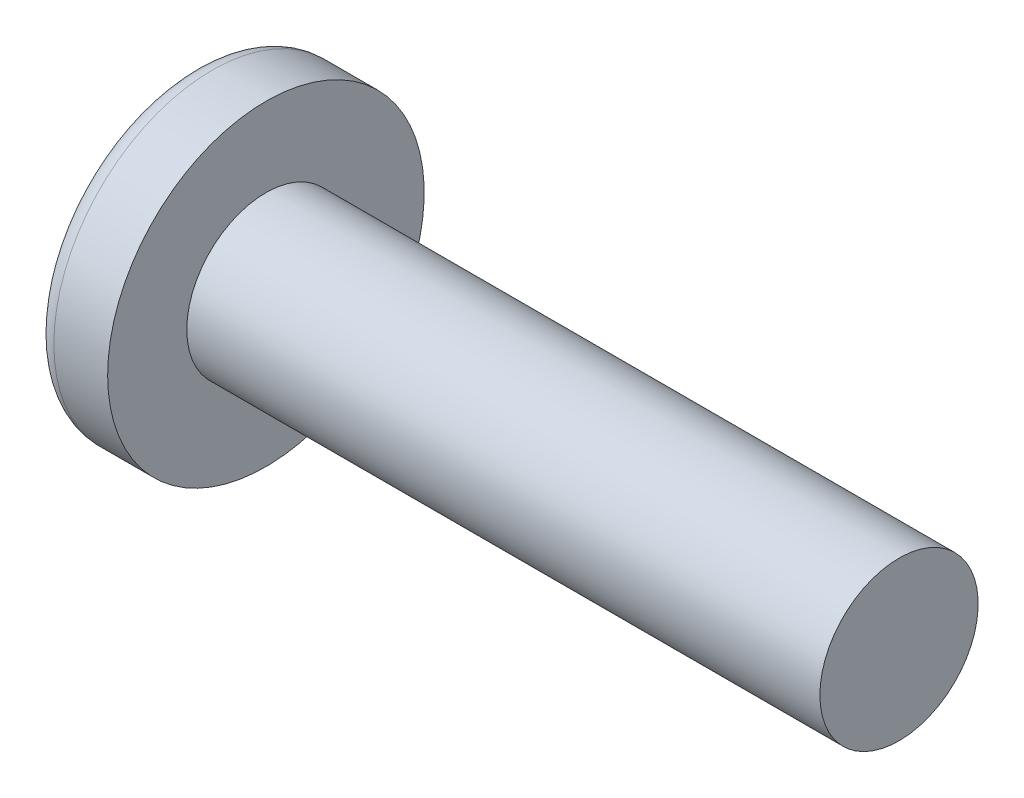
ISO-10303-21;
HEADER;
FILE_DESCRIPTION(('STEP AP214'),'2;1');
FILE_NAME('part.step','',(''),(''),'','','');
FILE_SCHEMA(('AUTOMOTIVE_DESIGN { 1 0 10303 214 1 1 1 1 }'));
ENDSEC;
DATA;
#1=APPLICATION_CONTEXT('core data for automotive mechanical design processes');
#2=APPLICATION_PROTOCOL_DEFINITION('international standard','automotive_design',2000,#1);
#3=PRODUCT_CONTEXT('',#1,'mechanical');
#4=PRODUCT('Part','Part','',(#3));
#5=PRODUCT_RELATED_PRODUCT_CATEGORY('part','',(#4));
#6=PRODUCT_DEFINITION_FORMATION('','',#4);
#7=PRODUCT_DEFINITION_CONTEXT('part definition',#1,'design');
#8=PRODUCT_DEFINITION('design','',#6,#7);
#9=PRODUCT_DEFINITION_SHAPE('','',#8);
#10=(LENGTH_UNIT() NAMED_UNIT(*) SI_UNIT(.MILLI.,.METRE.));
#11=(NAMED_UNIT(*) PLANE_ANGLE_UNIT() SI_UNIT($,.RADIAN.));
#12=(NAMED_UNIT(*) SI_UNIT($,.STERADIAN.) SOLID_ANGLE_UNIT());
#13=UNCERTAINTY_MEASURE_WITH_UNIT(LENGTH_MEASURE(1.E-05),#10,'distance_accuracy_value','');
#14=(GEOMETRIC_REPRESENTATION_CONTEXT(3) GLOBAL_UNCERTAINTY_ASSIGNED_CONTEXT((#13)) GLOBAL_UNIT_ASSIGNED_CONTEXT((#10,
#11,#12)) REPRESENTATION_CONTEXT('',''));
#15=CARTESIAN_POINT('',(0.,0.,0.));
#16=DIRECTION('',(0.,0.,1.));
#17=DIRECTION('',(1.,0.,0.));
#18=AXIS2_PLACEMENT_3D('',#15,#16,#17);
#19=CARTESIAN_POINT('',(16.,0.,0.));
#20=DIRECTION('',(-1.,0.,0.));
#21=DIRECTION('',(0.,1.,0.));
#22=AXIS2_PLACEMENT_3D('',#19,#20,#21);
#23=SPHERICAL_SURFACE('',#22,16.);
#24=CARTESIAN_POINT('',(3.13558937890291,0.,0.));
#25=DIRECTION('',(-1.,0.,0.));
#26=DIRECTION('',(0.,0.,1.));
#27=AXIS2_PLACEMENT_3D('',#24,#25,#26);
#28=CIRCLE('',#27,9.51351351351351);
#29=CARTESIAN_POINT('',(3.13558937890291,0.,9.51351351351351));
#30=VERTEX_POINT('',#29);
#31=EDGE_CURVE('E152',#30,#30,#28,.T.);
#32=ORIENTED_EDGE('',*,*,#31,.T.);
#33=EDGE_LOOP('',(#32));
#34=FACE_BOUND('',#33,.T.);
#35=CARTESIAN_POINT('',(15.9783292627018,-0.286901717708185,0.));
#36=DIRECTION('',(-0.0753191069988102,-0.997159481788596,0.));
#37=DIRECTION('',(0.997159481788596,-0.0753191069988102,0.));
#38=AXIS2_PLACEMENT_3D('',#35,#36,#37);
#39=CIRCLE('',#38,15.9974128465674);
#40=CARTESIAN_POINT('',(0.689797493113337,0.867897069485676,4.56557267764947));
#41=VERTEX_POINT('',#40);
#42=CARTESIAN_POINT('',(0.0525309152497253,0.916032147616602,0.916032147616605));
#43=VERTEX_POINT('',#42);
#44=EDGE_CURVE('E183',#41,#43,#39,.T.);
#45=ORIENTED_EDGE('',*,*,#44,.F.);
#46=CARTESIAN_POINT('',(12.5917266638189,0.,-4.48302043571123));
#47=DIRECTION('',(0.605215831317699,0.,0.796061428234295));
#48=DIRECTION('',(0.796061428234295,0.,-0.605215831317699));
#49=AXIS2_PLACEMENT_3D('',#46,#47,#48);
#50=CIRCLE('',#49,14.9761877872465);
#51=CARTESIAN_POINT('',(0.689797493113337,-0.867897069485708,4.56557267764947));
#52=VERTEX_POINT('',#51);
#53=EDGE_CURVE('E148',#41,#52,#50,.T.);
#54=ORIENTED_EDGE('',*,*,#53,.T.);
#55=CARTESIAN_POINT('',(15.9783292627018,0.286901717708185,0.));
#56=DIRECTION('',(-0.0753191069988101,0.997159481788596,0.));
#57=DIRECTION('',(-0.997159481788596,-0.0753191069988101,0.));
#58=AXIS2_PLACEMENT_3D('',#55,#56,#57);
#59=CIRCLE('',#58,15.9974128465674);
#60=CARTESIAN_POINT('',(0.0525309152497253,-0.916032147616608,0.916032147616604));
#61=VERTEX_POINT('',#60);
#62=EDGE_CURVE('E104',#61,#52,#59,.T.);
#63=ORIENTED_EDGE('',*,*,#62,.F.);
#64=CARTESIAN_POINT('',(15.9783292627018,0.,-0.286901717708185));
#65=DIRECTION('',(-0.0753191069988101,0.,-0.997159481788596));
#66=DIRECTION('',(-0.997159481788596,0.,0.0753191069988101));
#67=AXIS2_PLACEMENT_3D('',#64,#65,#66);
#68=CIRCLE('',#67,15.9974128465674);
#69=CARTESIAN_POINT('',(0.689797493113332,-4.56557267764947,0.867897069485691));
#70=VERTEX_POINT('',#69);
#71=EDGE_CURVE('E129',#70,#61,#68,.T.);
#72=ORIENTED_EDGE('',*,*,#71,.F.);
#73=CARTESIAN_POINT('',(12.5917266638189,4.48302043571123,0.));
#74=DIRECTION('',(0.605215831317699,-0.796061428234295,0.));
#75=DIRECTION('',(0.796061428234295,0.605215831317699,0.));
#76=AXIS2_PLACEMENT_3D('',#73,#74,#75);
#77=CIRCLE('',#76,14.9761877872465);
#78=CARTESIAN_POINT('',(0.689797493113332,-4.56557267764947,-0.867897069485692));
#79=VERTEX_POINT('',#78);
#80=EDGE_CURVE('E137',#70,#79,#77,.T.);
#81=ORIENTED_EDGE('',*,*,#80,.T.);
#82=CARTESIAN_POINT('',(15.9783292627018,0.,0.286901717708185));
#83=DIRECTION('',(-0.0753191069988102,0.,0.997159481788596));
#84=DIRECTION('',(0.997159481788596,0.,0.0753191069988102));
#85=AXIS2_PLACEMENT_3D('',#82,#83,#84);
#86=CIRCLE('',#85,15.9974128465674);
#87=CARTESIAN_POINT('',(0.0525309152497253,-0.916032147616601,-0.916032147616605));
#88=VERTEX_POINT('',#87);
#89=EDGE_CURVE('E47',#88,#79,#86,.T.);
#90=ORIENTED_EDGE('',*,*,#89,.F.);
#91=CARTESIAN_POINT('',(0.689797493113332,-0.867897069485675,-4.56557267764947));
#92=VERTEX_POINT('',#91);
#93=EDGE_CURVE('E190',#92,#88,#59,.T.);
#94=ORIENTED_EDGE('',*,*,#93,.F.);
#95=CARTESIAN_POINT('',(12.5917266638189,0.,4.48302043571123));
#96=DIRECTION('',(0.605215831317699,0.,-0.796061428234295));
#97=DIRECTION('',(-0.796061428234295,0.,-0.605215831317699));
#98=AXIS2_PLACEMENT_3D('',#95,#96,#97);
#99=CIRCLE('',#98,14.9761877872465);
#100=CARTESIAN_POINT('',(0.689797493113334,0.867897069485708,-4.56557267764947));
#101=VERTEX_POINT('',#100);
#102=EDGE_CURVE('E130',#92,#101,#99,.T.);
#103=ORIENTED_EDGE('',*,*,#102,.T.);
#104=CARTESIAN_POINT('',(0.0525309152497253,0.916032147616608,-0.916032147616605));
#105=VERTEX_POINT('',#104);
#106=EDGE_CURVE('E178',#105,#101,#39,.T.);
#107=ORIENTED_EDGE('',*,*,#106,.F.);
#108=CARTESIAN_POINT('',(0.689797493113339,4.56557267764947,-0.867897069485692));
#109=VERTEX_POINT('',#108);
#110=EDGE_CURVE('E40',#109,#105,#86,.T.);
#111=ORIENTED_EDGE('',*,*,#110,.F.);
#112=CARTESIAN_POINT('',(12.5917266638189,-4.48302043571123,0.));
#113=DIRECTION('',(0.605215831317699,0.796061428234295,0.));
#114=DIRECTION('',(-0.796061428234295,0.605215831317699,0.));
#115=AXIS2_PLACEMENT_3D('',#112,#113,#114);
#116=CIRCLE('',#115,14.9761877872465);
#117=CARTESIAN_POINT('',(0.689797493113339,4.56557267764947,0.867897069485692));
#118=VERTEX_POINT('',#117);
#119=EDGE_CURVE('E11',#109,#118,#116,.T.);
#120=ORIENTED_EDGE('',*,*,#119,.T.);
#121=EDGE_CURVE('E166',#43,#118,#68,.T.);
#122=ORIENTED_EDGE('',*,*,#121,.F.);
#123=EDGE_LOOP('',(#45,#54,#63,#72,#81,#90,#94,#103,#107,#111,#120,#122));
#124=FACE_BOUND('',#123,.T.);
#125=ADVANCED_FACE('F32',(#34,#124),#23,.T.);
#126=CARTESIAN_POINT('',(6.69505399568035,0.,-0.414298056155508));
#127=DIRECTION('',(-0.0753191069988102,0.,0.997159481788596));
#128=DIRECTION('',(0.997159481788596,0.,0.0753191069988102));
#129=AXIS2_PLACEMENT_3D('',#126,#127,#128);
#130=PLANE('',#129);
#131=ORIENTED_EDGE('',*,*,#110,.T.);
#132=DIRECTION('',(0.994343032504054,-0.0751063702712424,0.0751063702712422));
#133=VECTOR('',#132,1.);
#134=CARTESIAN_POINT('',(6.72599439429394,0.411961014552512,-0.41196101455251));
#135=LINE('',#134,#133);
#136=CARTESIAN_POINT('',(6.09,0.460000000000002,-0.459999999999998));
#137=VERTEX_POINT('',#136);
#138=EDGE_CURVE('E172',#105,#137,#135,.T.);
#139=ORIENTED_EDGE('',*,*,#138,.T.);
#140=DIRECTION('',(0.794626219349906,-0.60412469549919,0.0600210280625545));
#141=VECTOR('',#140,1.);
#142=CARTESIAN_POINT('',(0.,5.09,-0.92));
#143=LINE('',#142,#141);
#144=EDGE_CURVE('E153',#109,#137,#143,.T.);
#145=ORIENTED_EDGE('',*,*,#144,.F.);
#146=EDGE_LOOP('',(#131,#139,#145));
#147=FACE_BOUND('',#146,.T.);
#148=ADVANCED_FACE('F171',(#147),#130,.T.);
#149=DIRECTION('',(0.794626219349906,0.60412469549919,0.0600210280625545));
#150=VECTOR('',#149,1.);
#151=CARTESIAN_POINT('',(0.,-5.09,-0.92));
#152=LINE('',#151,#150);
#153=CARTESIAN_POINT('',(6.09,-0.46,-0.46));
#154=VERTEX_POINT('',#153);
#155=EDGE_CURVE('E138',#79,#154,#152,.T.);
#156=ORIENTED_EDGE('',*,*,#155,.T.);
#157=DIRECTION('',(-0.994343032504054,-0.0751063702712418,-0.0751063702712422));
#158=VECTOR('',#157,1.);
#159=CARTESIAN_POINT('',(6.72599439429394,-0.411961014552509,-0.41196101455251));
#160=LINE('',#159,#158);
#161=EDGE_CURVE('E193',#154,#88,#160,.T.);
#162=ORIENTED_EDGE('',*,*,#161,.T.);
#163=ORIENTED_EDGE('',*,*,#89,.T.);
#164=EDGE_LOOP('',(#156,#162,#163));
#165=FACE_BOUND('',#164,.T.);
#166=ADVANCED_FACE('F208',(#165),#130,.T.);
#167=CARTESIAN_POINT('',(6.69505399568034,0.,0.414298056155508));
#168=DIRECTION('',(-0.0753191069988101,0.,-0.997159481788596));
#169=DIRECTION('',(-0.997159481788596,0.,0.0753191069988101));
#170=AXIS2_PLACEMENT_3D('',#167,#168,#169);
#171=PLANE('',#170);
#172=DIRECTION('',(0.794626219349906,-0.60412469549919,-0.0600210280625545));
#173=VECTOR('',#172,1.);
#174=CARTESIAN_POINT('',(0.,5.09,0.92));
#175=LINE('',#174,#173);
#176=CARTESIAN_POINT('',(6.09,0.460000000000001,0.46));
#177=VERTEX_POINT('',#176);
#178=EDGE_CURVE('E209',#118,#177,#175,.T.);
#179=ORIENTED_EDGE('',*,*,#178,.T.);
#180=DIRECTION('',(-0.994343032504054,0.0751063702712419,0.0751063702712421));
#181=VECTOR('',#180,1.);
#182=CARTESIAN_POINT('',(6.72599439429394,0.411961014552509,0.411961014552511));
#183=LINE('',#182,#181);
#184=EDGE_CURVE('E187',#177,#43,#183,.T.);
#185=ORIENTED_EDGE('',*,*,#184,.T.);
#186=ORIENTED_EDGE('',*,*,#121,.T.);
#187=EDGE_LOOP('',(#179,#185,#186));
#188=FACE_BOUND('',#187,.T.);
#189=ADVANCED_FACE('F213',(#188),#171,.T.);
#190=ORIENTED_EDGE('',*,*,#71,.T.);
#191=DIRECTION('',(0.994343032504054,0.0751063702712424,-0.0751063702712421));
#192=VECTOR('',#191,1.);
#193=CARTESIAN_POINT('',(6.72599439429394,-0.411961014552512,0.41196101455251));
#194=LINE('',#193,#192);
#195=CARTESIAN_POINT('',(6.09,-0.460000000000002,0.459999999999999));
#196=VERTEX_POINT('',#195);
#197=EDGE_CURVE('E102',#61,#196,#194,.T.);
#198=ORIENTED_EDGE('',*,*,#197,.T.);
#199=DIRECTION('',(0.794626219349906,0.60412469549919,-0.0600210280625543));
#200=VECTOR('',#199,1.);
#201=CARTESIAN_POINT('',(0.,-5.09,0.919999999999999));
#202=LINE('',#201,#200);
#203=EDGE_CURVE('E127',#70,#196,#202,.T.);
#204=ORIENTED_EDGE('',*,*,#203,.F.);
#205=EDGE_LOOP('',(#190,#198,#204));
#206=FACE_BOUND('',#205,.T.);
#207=ADVANCED_FACE('F126',(#206),#171,.T.);
#208=CARTESIAN_POINT('',(-25.4,0.,0.));
#209=DIRECTION('',(-1.,0.,0.));
#210=DIRECTION('',(0.,0.,1.));
#211=AXIS2_PLACEMENT_3D('',#208,#209,#210);
#212=CYLINDRICAL_SURFACE('',#211,5.);
#213=CARTESIAN_POINT('',(47.5,0.,0.));
#214=DIRECTION('',(-1.,0.,0.));
#215=DIRECTION('',(0.,0.,1.));
#216=AXIS2_PLACEMENT_3D('',#213,#214,#215);
#217=CIRCLE('',#216,5.);
#218=CARTESIAN_POINT('',(47.5,0.,5.));
#219=VERTEX_POINT('',#218);
#220=EDGE_CURVE('E149',#219,#219,#217,.T.);
#221=ORIENTED_EDGE('',*,*,#220,.T.);
#222=EDGE_LOOP('',(#221));
#223=FACE_BOUND('',#222,.T.);
#224=CARTESIAN_POINT('',(7.5,0.,0.));
#225=DIRECTION('',(-1.,0.,0.));
#226=DIRECTION('',(0.,0.,1.));
#227=AXIS2_PLACEMENT_3D('',#224,#225,#226);
#228=CIRCLE('',#227,5.);
#229=CARTESIAN_POINT('',(7.5,0.,5.));
#230=VERTEX_POINT('',#229);
#231=EDGE_CURVE('E162',#230,#230,#228,.T.);
#232=ORIENTED_EDGE('',*,*,#231,.F.);
#233=EDGE_LOOP('',(#232));
#234=FACE_BOUND('',#233,.T.);
#235=ADVANCED_FACE('F34',(#223,#234),#212,.T.);
#236=CARTESIAN_POINT('',(7.5,5.,0.));
#237=DIRECTION('',(-1.,0.,0.));
#238=DIRECTION('',(0.,0.,1.));
#239=AXIS2_PLACEMENT_3D('',#236,#237,#238);
#240=PLANE('',#239);
#241=CARTESIAN_POINT('',(7.5,0.,0.));
#242=DIRECTION('',(-1.,0.,0.));
#243=DIRECTION('',(0.,0.,1.));
#244=AXIS2_PLACEMENT_3D('',#241,#242,#243);
#245=CIRCLE('',#244,10.);
#246=CARTESIAN_POINT('',(7.5,0.,10.));
#247=VERTEX_POINT('',#246);
#248=EDGE_CURVE('E159',#247,#247,#245,.T.);
#249=ORIENTED_EDGE('',*,*,#248,.F.);
#250=EDGE_LOOP('',(#249));
#251=FACE_BOUND('',#250,.T.);
#252=ORIENTED_EDGE('',*,*,#231,.T.);
#253=EDGE_LOOP('',(#252));
#254=FACE_BOUND('',#253,.T.);
#255=ADVANCED_FACE('F241',(#251,#254),#240,.F.);
#256=CARTESIAN_POINT('',(-25.4,0.,0.));
#257=DIRECTION('',(-1.,0.,0.));
#258=DIRECTION('',(0.,0.,1.));
#259=AXIS2_PLACEMENT_3D('',#256,#257,#258);
#260=CYLINDRICAL_SURFACE('',#259,10.);
#261=ORIENTED_EDGE('',*,*,#248,.T.);
#262=EDGE_LOOP('',(#261));
#263=FACE_BOUND('',#262,.T.);
#264=CARTESIAN_POINT('',(4.10042017548519,0.,0.));
#265=DIRECTION('',(-1.,0.,0.));
#266=DIRECTION('',(0.,0.,1.));
#267=AXIS2_PLACEMENT_3D('',#264,#265,#266);
#268=CIRCLE('',#267,10.);
#269=CARTESIAN_POINT('',(4.10042017548519,0.,10.));
#270=VERTEX_POINT('',#269);
#271=EDGE_CURVE('E156',#270,#270,#268,.T.);
#272=ORIENTED_EDGE('',*,*,#271,.F.);
#273=EDGE_LOOP('',(#272));
#274=FACE_BOUND('',#273,.T.);
#275=ADVANCED_FACE('F238',(#263,#274),#260,.T.);
#276=CARTESIAN_POINT('',(4.10042017548519,0.,0.));
#277=DIRECTION('',(-1.,0.,0.));
#278=DIRECTION('',(0.,0.,1.));
#279=AXIS2_PLACEMENT_3D('',#276,#277,#278);
#280=TOROIDAL_SURFACE('',#279,8.8,1.2);
#281=ORIENTED_EDGE('',*,*,#271,.T.);
#282=EDGE_LOOP('',(#281));
#283=FACE_BOUND('',#282,.T.);
#284=ORIENTED_EDGE('',*,*,#31,.F.);
#285=EDGE_LOOP('',(#284));
#286=FACE_BOUND('',#285,.T.);
#287=ADVANCED_FACE('F235',(#283,#286),#280,.T.);
#288=CARTESIAN_POINT('',(47.5,5.,0.));
#289=DIRECTION('',(1.,0.,0.));
#290=DIRECTION('',(0.,0.,-1.));
#291=AXIS2_PLACEMENT_3D('',#288,#289,#290);
#292=PLANE('',#291);
#293=ORIENTED_EDGE('',*,*,#220,.F.);
#294=EDGE_LOOP('',(#293));
#295=FACE_BOUND('',#294,.T.);
#296=ADVANCED_FACE('F233',(#295),#292,.T.);
#297=CARTESIAN_POINT('',(6.09,0.46,0.46));
#298=DIRECTION('',(0.605215831317699,0.796061428234295,0.));
#299=DIRECTION('',(-0.796061428234295,0.605215831317699,0.));
#300=AXIS2_PLACEMENT_3D('',#297,#298,#299);
#301=PLANE('',#300);
#302=ORIENTED_EDGE('',*,*,#144,.T.);
#303=DIRECTION('',(0.,0.,-1.));
#304=VECTOR('',#303,1.);
#305=CARTESIAN_POINT('',(6.09,0.46,0.46));
#306=LINE('',#305,#304);
#307=EDGE_CURVE('E120',#177,#137,#306,.T.);
#308=ORIENTED_EDGE('',*,*,#307,.F.);
#309=ORIENTED_EDGE('',*,*,#178,.F.);
#310=ORIENTED_EDGE('',*,*,#119,.F.);
#311=EDGE_LOOP('',(#302,#308,#309,#310));
#312=FACE_BOUND('',#311,.T.);
#313=ADVANCED_FACE('F212',(#312),#301,.F.);
#314=CARTESIAN_POINT('',(6.09,-0.46,-0.46));
#315=DIRECTION('',(0.605215831317699,-0.796061428234295,0.));
#316=DIRECTION('',(0.796061428234295,0.605215831317699,0.));
#317=AXIS2_PLACEMENT_3D('',#314,#315,#316);
#318=PLANE('',#317);
#319=ORIENTED_EDGE('',*,*,#203,.T.);
#320=DIRECTION('',(0.,0.,1.));
#321=VECTOR('',#320,1.);
#322=CARTESIAN_POINT('',(6.09,-0.46,-0.46));
#323=LINE('',#322,#321);
#324=EDGE_CURVE('E119',#154,#196,#323,.T.);
#325=ORIENTED_EDGE('',*,*,#324,.F.);
#326=ORIENTED_EDGE('',*,*,#155,.F.);
#327=ORIENTED_EDGE('',*,*,#80,.F.);
#328=EDGE_LOOP('',(#319,#325,#326,#327));
#329=FACE_BOUND('',#328,.T.);
#330=ADVANCED_FACE('F134',(#329),#318,.F.);
#331=CARTESIAN_POINT('',(6.09,0.46,-0.46));
#332=DIRECTION('',(-1.,0.,0.));
#333=DIRECTION('',(0.,0.,1.));
#334=AXIS2_PLACEMENT_3D('',#331,#332,#333);
#335=PLANE('',#334);
#336=DIRECTION('',(0.,1.,0.));
#337=VECTOR('',#336,1.);
#338=CARTESIAN_POINT('',(6.09,-0.46,-0.46));
#339=LINE('',#338,#337);
#340=EDGE_CURVE('E142',#154,#137,#339,.T.);
#341=ORIENTED_EDGE('',*,*,#340,.F.);
#342=ORIENTED_EDGE('',*,*,#324,.T.);
#343=DIRECTION('',(0.,-1.,0.));
#344=VECTOR('',#343,1.);
#345=CARTESIAN_POINT('',(6.09,0.46,0.46));
#346=LINE('',#345,#344);
#347=EDGE_CURVE('E111',#177,#196,#346,.T.);
#348=ORIENTED_EDGE('',*,*,#347,.F.);
#349=ORIENTED_EDGE('',*,*,#307,.T.);
#350=EDGE_LOOP('',(#341,#342,#348,#349));
#351=FACE_BOUND('',#350,.T.);
#352=ADVANCED_FACE('F140',(#351),#335,.T.);
#353=CARTESIAN_POINT('',(6.09,0.460000000000002,-0.459999999999998));
#354=DIRECTION('',(0.605215831317699,0.,-0.796061428234295));
#355=DIRECTION('',(0.796061428234295,0.,0.605215831317699));
#356=AXIS2_PLACEMENT_3D('',#353,#354,#355);
#357=PLANE('',#356);
#358=DIRECTION('',(0.794626219349906,0.0600210280625522,0.60412469549919));
#359=VECTOR('',#358,1.);
#360=CARTESIAN_POINT('',(0.,-0.919999999999981,-5.09));
#361=LINE('',#360,#359);
#362=EDGE_CURVE('E198',#92,#154,#361,.T.);
#363=ORIENTED_EDGE('',*,*,#362,.T.);
#364=ORIENTED_EDGE('',*,*,#340,.T.);
#365=DIRECTION('',(0.794626219349906,-0.0600210280625566,0.60412469549919));
#366=VECTOR('',#365,1.);
#367=CARTESIAN_POINT('',(0.,0.920000000000018,-5.09));
#368=LINE('',#367,#366);
#369=EDGE_CURVE('E108',#101,#137,#368,.T.);
#370=ORIENTED_EDGE('',*,*,#369,.F.);
#371=ORIENTED_EDGE('',*,*,#102,.F.);
#372=EDGE_LOOP('',(#363,#364,#370,#371));
#373=FACE_BOUND('',#372,.T.);
#374=ADVANCED_FACE('F203',(#373),#357,.F.);
#375=CARTESIAN_POINT('',(6.69505399568034,-0.414298056155508,0.));
#376=DIRECTION('',(-0.0753191069988101,0.997159481788596,0.));
#377=DIRECTION('',(-0.997159481788596,-0.0753191069988101,0.));
#378=AXIS2_PLACEMENT_3D('',#375,#376,#377);
#379=PLANE('',#378);
#380=ORIENTED_EDGE('',*,*,#93,.T.);
#381=ORIENTED_EDGE('',*,*,#161,.F.);
#382=ORIENTED_EDGE('',*,*,#362,.F.);
#383=EDGE_LOOP('',(#380,#381,#382));
#384=FACE_BOUND('',#383,.T.);
#385=ADVANCED_FACE('F207',(#384),#379,.T.);
#386=CARTESIAN_POINT('',(6.69505399568035,0.414298056155508,0.));
#387=DIRECTION('',(-0.0753191069988102,-0.997159481788596,0.));
#388=DIRECTION('',(0.997159481788596,-0.0753191069988102,0.));
#389=AXIS2_PLACEMENT_3D('',#386,#387,#388);
#390=PLANE('',#389);
#391=ORIENTED_EDGE('',*,*,#106,.T.);
#392=ORIENTED_EDGE('',*,*,#369,.T.);
#393=ORIENTED_EDGE('',*,*,#138,.F.);
#394=EDGE_LOOP('',(#391,#392,#393));
#395=FACE_BOUND('',#394,.T.);
#396=ADVANCED_FACE('F201',(#395),#390,.T.);
#397=CARTESIAN_POINT('',(6.09,-0.460000000000002,0.459999999999998));
#398=DIRECTION('',(0.605215831317699,0.,0.796061428234295));
#399=DIRECTION('',(-0.796061428234295,0.,0.605215831317699));
#400=AXIS2_PLACEMENT_3D('',#397,#398,#399);
#401=PLANE('',#400);
#402=DIRECTION('',(0.794626219349906,-0.0600210280625524,-0.60412469549919));
#403=VECTOR('',#402,1.);
#404=CARTESIAN_POINT('',(0.,0.919999999999982,5.09));
#405=LINE('',#404,#403);
#406=EDGE_CURVE('E107',#41,#177,#405,.T.);
#407=ORIENTED_EDGE('',*,*,#406,.T.);
#408=ORIENTED_EDGE('',*,*,#347,.T.);
#409=DIRECTION('',(0.794626219349906,0.0600210280625566,-0.604124695499189));
#410=VECTOR('',#409,1.);
#411=CARTESIAN_POINT('',(0.,-0.920000000000018,5.09));
#412=LINE('',#411,#410);
#413=EDGE_CURVE('E98',#52,#196,#412,.T.);
#414=ORIENTED_EDGE('',*,*,#413,.F.);
#415=ORIENTED_EDGE('',*,*,#53,.F.);
#416=EDGE_LOOP('',(#407,#408,#414,#415));
#417=FACE_BOUND('',#416,.T.);
#418=ADVANCED_FACE('F112',(#417),#401,.F.);
#419=ORIENTED_EDGE('',*,*,#44,.T.);
#420=ORIENTED_EDGE('',*,*,#184,.F.);
#421=ORIENTED_EDGE('',*,*,#406,.F.);
#422=EDGE_LOOP('',(#419,#420,#421));
#423=FACE_BOUND('',#422,.T.);
#424=ADVANCED_FACE('F214',(#423),#390,.T.);
#425=ORIENTED_EDGE('',*,*,#62,.T.);
#426=ORIENTED_EDGE('',*,*,#413,.T.);
#427=ORIENTED_EDGE('',*,*,#197,.F.);
#428=EDGE_LOOP('',(#425,#426,#427));
#429=FACE_BOUND('',#428,.T.);
#430=ADVANCED_FACE('F100',(#429),#379,.T.);
#431=CLOSED_SHELL('',(#125,#148,#166,#189,#207,#235,#255,#275,#287,#296,#313,#330,#352,#374,
#385,#396,#418,#424,#430));
#432=MANIFOLD_SOLID_BREP('B2',#431);
#433=ADVANCED_BREP_SHAPE_REPRESENTATION('',(#18,#432),#14);
#434=SHAPE_DEFINITION_REPRESENTATION(#9,#433);
ENDSEC;
END-ISO-10303-21;
